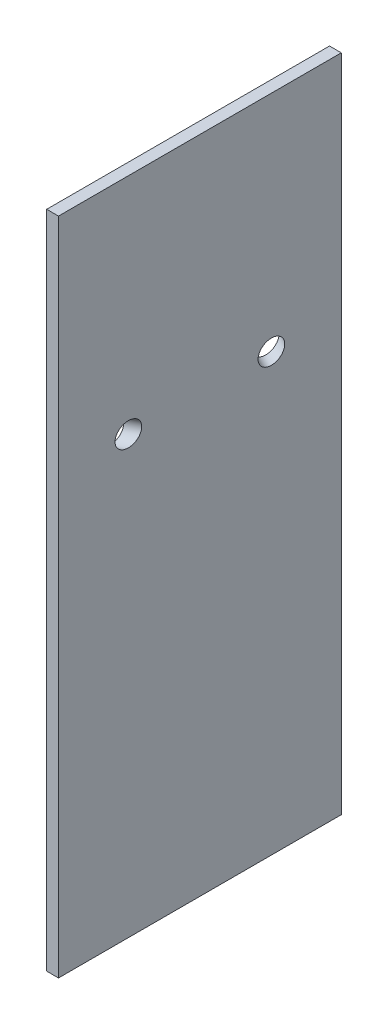
ISO-10303-21;
HEADER;
FILE_DESCRIPTION(('STEP AP214'),'2;1');
FILE_NAME('part.step','',(''),(''),'','','');
FILE_SCHEMA(('AUTOMOTIVE_DESIGN { 1 0 10303 214 1 1 1 1 }'));
ENDSEC;
DATA;
#1=APPLICATION_CONTEXT('core data for automotive mechanical design processes');
#2=APPLICATION_PROTOCOL_DEFINITION('international standard','automotive_design',2000,#1);
#3=PRODUCT_CONTEXT('',#1,'mechanical');
#4=PRODUCT('Part','Part','',(#3));
#5=PRODUCT_RELATED_PRODUCT_CATEGORY('part','',(#4));
#6=PRODUCT_DEFINITION_FORMATION('','',#4);
#7=PRODUCT_DEFINITION_CONTEXT('part definition',#1,'design');
#8=PRODUCT_DEFINITION('design','',#6,#7);
#9=PRODUCT_DEFINITION_SHAPE('','',#8);
#10=(LENGTH_UNIT() NAMED_UNIT(*) SI_UNIT(.MILLI.,.METRE.));
#11=(NAMED_UNIT(*) PLANE_ANGLE_UNIT() SI_UNIT($,.RADIAN.));
#12=(NAMED_UNIT(*) SI_UNIT($,.STERADIAN.) SOLID_ANGLE_UNIT());
#13=UNCERTAINTY_MEASURE_WITH_UNIT(LENGTH_MEASURE(1.E-05),#10,'distance_accuracy_value','');
#14=(GEOMETRIC_REPRESENTATION_CONTEXT(3) GLOBAL_UNCERTAINTY_ASSIGNED_CONTEXT((#13)) GLOBAL_UNIT_ASSIGNED_CONTEXT((#10,
#11,#12)) REPRESENTATION_CONTEXT('',''));
#15=CARTESIAN_POINT('',(0.,0.,0.));
#16=DIRECTION('',(0.,0.,1.));
#17=DIRECTION('',(1.,0.,0.));
#18=AXIS2_PLACEMENT_3D('',#15,#16,#17);
#19=CARTESIAN_POINT('',(6.35,355.6,-152.4));
#20=DIRECTION('',(0.,0.,1.));
#21=DIRECTION('',(0.,-1.,0.));
#22=AXIS2_PLACEMENT_3D('',#19,#20,#21);
#23=PLANE('',#22);
#24=DIRECTION('',(0.,1.,0.));
#25=VECTOR('',#24,1.);
#26=CARTESIAN_POINT('',(-6.35,355.6,-152.4));
#27=LINE('',#26,#25);
#28=CARTESIAN_POINT('',(-6.35,-355.6,-152.4));
#29=VERTEX_POINT('',#28);
#30=CARTESIAN_POINT('',(-6.35,355.6,-152.4));
#31=VERTEX_POINT('',#30);
#32=EDGE_CURVE('E118',#29,#31,#27,.T.);
#33=ORIENTED_EDGE('',*,*,#32,.T.);
#34=DIRECTION('',(-1.,0.,0.));
#35=VECTOR('',#34,1.);
#36=CARTESIAN_POINT('',(6.35,355.6,-152.4));
#37=LINE('',#36,#35);
#38=CARTESIAN_POINT('',(6.35,355.6,-152.4));
#39=VERTEX_POINT('',#38);
#40=EDGE_CURVE('E103',#39,#31,#37,.T.);
#41=ORIENTED_EDGE('',*,*,#40,.F.);
#42=DIRECTION('',(0.,1.,0.));
#43=VECTOR('',#42,1.);
#44=CARTESIAN_POINT('',(6.35,355.6,-152.4));
#45=LINE('',#44,#43);
#46=CARTESIAN_POINT('',(6.35,-355.6,-152.4));
#47=VERTEX_POINT('',#46);
#48=EDGE_CURVE('E125',#47,#39,#45,.T.);
#49=ORIENTED_EDGE('',*,*,#48,.F.);
#50=DIRECTION('',(-1.,0.,0.));
#51=VECTOR('',#50,1.);
#52=CARTESIAN_POINT('',(6.35,-355.6,-152.4));
#53=LINE('',#52,#51);
#54=EDGE_CURVE('E105',#47,#29,#53,.T.);
#55=ORIENTED_EDGE('',*,*,#54,.T.);
#56=EDGE_LOOP('',(#33,#41,#49,#55));
#57=FACE_BOUND('',#56,.T.);
#58=ADVANCED_FACE('F46',(#57),#23,.F.);
#59=CARTESIAN_POINT('',(6.35,355.6,152.4));
#60=DIRECTION('',(0.,-1.,0.));
#61=DIRECTION('',(0.,0.,-1.));
#62=AXIS2_PLACEMENT_3D('',#59,#60,#61);
#63=PLANE('',#62);
#64=DIRECTION('',(0.,0.,1.));
#65=VECTOR('',#64,1.);
#66=CARTESIAN_POINT('',(-6.35,355.6,152.4));
#67=LINE('',#66,#65);
#68=CARTESIAN_POINT('',(-6.35,355.6,152.4));
#69=VERTEX_POINT('',#68);
#70=EDGE_CURVE('E66',#31,#69,#67,.T.);
#71=ORIENTED_EDGE('',*,*,#70,.T.);
#72=DIRECTION('',(-1.,0.,0.));
#73=VECTOR('',#72,1.);
#74=CARTESIAN_POINT('',(6.35,355.6,152.4));
#75=LINE('',#74,#73);
#76=CARTESIAN_POINT('',(6.35,355.6,152.4));
#77=VERTEX_POINT('',#76);
#78=EDGE_CURVE('E100',#77,#69,#75,.T.);
#79=ORIENTED_EDGE('',*,*,#78,.F.);
#80=DIRECTION('',(0.,0.,1.));
#81=VECTOR('',#80,1.);
#82=CARTESIAN_POINT('',(6.35,355.6,152.4));
#83=LINE('',#82,#81);
#84=EDGE_CURVE('E82',#39,#77,#83,.T.);
#85=ORIENTED_EDGE('',*,*,#84,.F.);
#86=ORIENTED_EDGE('',*,*,#40,.T.);
#87=EDGE_LOOP('',(#71,#79,#85,#86));
#88=FACE_BOUND('',#87,.T.);
#89=ADVANCED_FACE('F99',(#88),#63,.F.);
#90=CARTESIAN_POINT('',(6.35,355.6,152.4));
#91=DIRECTION('',(0.,0.,-1.));
#92=DIRECTION('',(0.,1.,0.));
#93=AXIS2_PLACEMENT_3D('',#90,#91,#92);
#94=PLANE('',#93);
#95=DIRECTION('',(0.,-1.,0.));
#96=VECTOR('',#95,1.);
#97=CARTESIAN_POINT('',(-6.35,355.6,152.4));
#98=LINE('',#97,#96);
#99=CARTESIAN_POINT('',(-6.35,-355.6,152.4));
#100=VERTEX_POINT('',#99);
#101=EDGE_CURVE('E97',#69,#100,#98,.T.);
#102=ORIENTED_EDGE('',*,*,#101,.T.);
#103=DIRECTION('',(-1.,0.,0.));
#104=VECTOR('',#103,1.);
#105=CARTESIAN_POINT('',(6.35,-355.6,152.4));
#106=LINE('',#105,#104);
#107=CARTESIAN_POINT('',(6.35,-355.6,152.4));
#108=VERTEX_POINT('',#107);
#109=EDGE_CURVE('E130',#108,#100,#106,.T.);
#110=ORIENTED_EDGE('',*,*,#109,.F.);
#111=DIRECTION('',(0.,-1.,0.));
#112=VECTOR('',#111,1.);
#113=CARTESIAN_POINT('',(6.35,355.6,152.4));
#114=LINE('',#113,#112);
#115=EDGE_CURVE('E108',#77,#108,#114,.T.);
#116=ORIENTED_EDGE('',*,*,#115,.F.);
#117=ORIENTED_EDGE('',*,*,#78,.T.);
#118=EDGE_LOOP('',(#102,#110,#116,#117));
#119=FACE_BOUND('',#118,.T.);
#120=ADVANCED_FACE('F107',(#119),#94,.F.);
#121=CARTESIAN_POINT('',(6.35,-355.6,152.4));
#122=DIRECTION('',(0.,1.,0.));
#123=DIRECTION('',(0.,0.,1.));
#124=AXIS2_PLACEMENT_3D('',#121,#122,#123);
#125=PLANE('',#124);
#126=DIRECTION('',(0.,0.,-1.));
#127=VECTOR('',#126,1.);
#128=CARTESIAN_POINT('',(-6.35,-355.6,152.4));
#129=LINE('',#128,#127);
#130=EDGE_CURVE('E91',#100,#29,#129,.T.);
#131=ORIENTED_EDGE('',*,*,#130,.T.);
#132=ORIENTED_EDGE('',*,*,#54,.F.);
#133=DIRECTION('',(0.,0.,-1.));
#134=VECTOR('',#133,1.);
#135=CARTESIAN_POINT('',(6.35,-355.6,152.4));
#136=LINE('',#135,#134);
#137=EDGE_CURVE('E120',#108,#47,#136,.T.);
#138=ORIENTED_EDGE('',*,*,#137,.F.);
#139=ORIENTED_EDGE('',*,*,#109,.T.);
#140=EDGE_LOOP('',(#131,#132,#138,#139));
#141=FACE_BOUND('',#140,.T.);
#142=ADVANCED_FACE('F139',(#141),#125,.F.);
#143=CARTESIAN_POINT('',(6.35,0.,0.));
#144=DIRECTION('',(1.,0.,0.));
#145=DIRECTION('',(0.,0.,-1.));
#146=AXIS2_PLACEMENT_3D('',#143,#144,#145);
#147=PLANE('',#146);
#148=CARTESIAN_POINT('',(6.34999999999997,114.3,77.0805555555679));
#149=DIRECTION('',(1.,0.,0.));
#150=DIRECTION('',(0.,0.,1.));
#151=AXIS2_PLACEMENT_3D('',#148,#149,#150);
#152=ELLIPSE('',#151,14.360265663917,12.7);
#153=CARTESIAN_POINT('',(6.34999999999997,114.3,91.4408212194849));
#154=VERTEX_POINT('',#153);
#155=EDGE_CURVE('E127',#154,#154,#152,.F.);
#156=ORIENTED_EDGE('',*,*,#155,.T.);
#157=EDGE_LOOP('',(#156));
#158=FACE_BOUND('',#157,.T.);
#159=CARTESIAN_POINT('',(6.34999999999997,114.3,-77.0805555555697));
#160=DIRECTION('',(1.,0.,0.));
#161=DIRECTION('',(0.,0.,1.));
#162=AXIS2_PLACEMENT_3D('',#159,#160,#161);
#163=ELLIPSE('',#162,14.3602656639171,12.7);
#164=CARTESIAN_POINT('',(6.34999999999997,114.3,-62.7202898916527));
#165=VERTEX_POINT('',#164);
#166=EDGE_CURVE('E50',#165,#165,#163,.F.);
#167=ORIENTED_EDGE('',*,*,#166,.T.);
#168=EDGE_LOOP('',(#167));
#169=FACE_BOUND('',#168,.T.);
#170=ORIENTED_EDGE('',*,*,#48,.T.);
#171=ORIENTED_EDGE('',*,*,#84,.T.);
#172=ORIENTED_EDGE('',*,*,#115,.T.);
#173=ORIENTED_EDGE('',*,*,#137,.T.);
#174=EDGE_LOOP('',(#170,#171,#172,#173));
#175=FACE_BOUND('',#174,.T.);
#176=ADVANCED_FACE('F48',(#158,#169,#175),#147,.T.);
#177=CARTESIAN_POINT('',(-6.35,0.,0.));
#178=DIRECTION('',(1.,0.,0.));
#179=DIRECTION('',(0.,0.,-1.));
#180=AXIS2_PLACEMENT_3D('',#177,#178,#179);
#181=PLANE('',#180);
#182=CARTESIAN_POINT('',(-6.34999999999997,114.3,83.7833333333458));
#183=DIRECTION('',(1.,0.,0.));
#184=DIRECTION('',(0.,0.,1.));
#185=AXIS2_PLACEMENT_3D('',#182,#183,#184);
#186=ELLIPSE('',#185,14.360265663917,12.7);
#187=CARTESIAN_POINT('',(-6.34999999999997,114.3,98.1435989972629));
#188=VERTEX_POINT('',#187);
#189=EDGE_CURVE('E11',#188,#188,#186,.F.);
#190=ORIENTED_EDGE('',*,*,#189,.F.);
#191=EDGE_LOOP('',(#190));
#192=FACE_BOUND('',#191,.T.);
#193=CARTESIAN_POINT('',(-6.34999999999999,114.3,-83.7833333333478));
#194=DIRECTION('',(1.,0.,0.));
#195=DIRECTION('',(0.,0.,1.));
#196=AXIS2_PLACEMENT_3D('',#193,#194,#195);
#197=ELLIPSE('',#196,14.3602656639171,12.7);
#198=CARTESIAN_POINT('',(-6.34999999999999,114.3,-69.4230676694307));
#199=VERTEX_POINT('',#198);
#200=EDGE_CURVE('E57',#199,#199,#197,.F.);
#201=ORIENTED_EDGE('',*,*,#200,.F.);
#202=EDGE_LOOP('',(#201));
#203=FACE_BOUND('',#202,.T.);
#204=ORIENTED_EDGE('',*,*,#32,.F.);
#205=ORIENTED_EDGE('',*,*,#130,.F.);
#206=ORIENTED_EDGE('',*,*,#101,.F.);
#207=ORIENTED_EDGE('',*,*,#70,.F.);
#208=EDGE_LOOP('',(#204,#205,#206,#207));
#209=FACE_BOUND('',#208,.T.);
#210=ADVANCED_FACE('F110',(#192,#203,#209),#181,.F.);
#211=CARTESIAN_POINT('',(-226.549999999963,114.300000000001,-200.));
#212=DIRECTION('',(0.884384752846962,0.,0.466758619558138));
#213=DIRECTION('',(0.466758619558138,0.,-0.884384752846962));
#214=AXIS2_PLACEMENT_3D('',#211,#212,#213);
#215=CYLINDRICAL_SURFACE('',#214,12.7);
#216=ORIENTED_EDGE('',*,*,#166,.F.);
#217=EDGE_LOOP('',(#216));
#218=FACE_BOUND('',#217,.T.);
#219=ORIENTED_EDGE('',*,*,#200,.T.);
#220=EDGE_LOOP('',(#219));
#221=FACE_BOUND('',#220,.T.);
#222=ADVANCED_FACE('F144',(#218,#221),#215,.F.);
#223=CARTESIAN_POINT('',(673.45,114.299999999997,-275.));
#224=DIRECTION('',(-0.884384752846963,0.,0.466758619558136));
#225=DIRECTION('',(0.466758619558136,0.,0.884384752846963));
#226=AXIS2_PLACEMENT_3D('',#223,#224,#225);
#227=CYLINDRICAL_SURFACE('',#226,12.7);
#228=ORIENTED_EDGE('',*,*,#155,.F.);
#229=EDGE_LOOP('',(#228));
#230=FACE_BOUND('',#229,.T.);
#231=ORIENTED_EDGE('',*,*,#189,.T.);
#232=EDGE_LOOP('',(#231));
#233=FACE_BOUND('',#232,.T.);
#234=ADVANCED_FACE('F157',(#230,#233),#227,.F.);
#235=CLOSED_SHELL('',(#58,#89,#120,#142,#176,#210,#222,#234));
#236=MANIFOLD_SOLID_BREP('B2',#235);
#237=ADVANCED_BREP_SHAPE_REPRESENTATION('',(#18,#236),#14);
#238=SHAPE_DEFINITION_REPRESENTATION(#9,#237);
ENDSEC;
END-ISO-10303-21;
